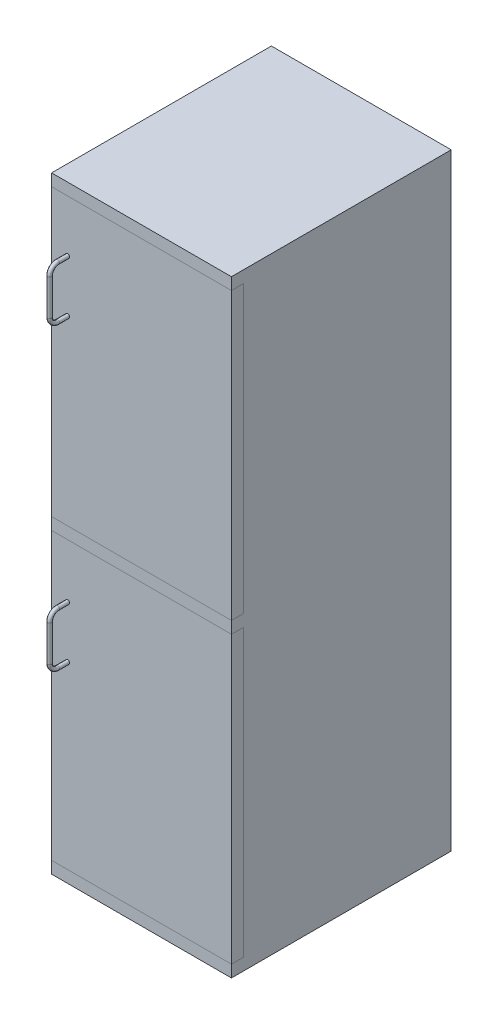
ISO-10303-21;
HEADER;
FILE_DESCRIPTION(('STEP AP214'),'2;1');
FILE_NAME('part.step','',(''),(''),'','','');
FILE_SCHEMA(('AUTOMOTIVE_DESIGN { 1 0 10303 214 1 1 1 1 }'));
ENDSEC;
DATA;
#1=APPLICATION_CONTEXT('core data for automotive mechanical design processes');
#2=APPLICATION_PROTOCOL_DEFINITION('international standard','automotive_design',2000,#1);
#3=PRODUCT_CONTEXT('',#1,'mechanical');
#4=PRODUCT('Part','Part','',(#3));
#5=PRODUCT_RELATED_PRODUCT_CATEGORY('part','',(#4));
#6=PRODUCT_DEFINITION_FORMATION('','',#4);
#7=PRODUCT_DEFINITION_CONTEXT('part definition',#1,'design');
#8=PRODUCT_DEFINITION('design','',#6,#7);
#9=PRODUCT_DEFINITION_SHAPE('','',#8);
#10=(LENGTH_UNIT() NAMED_UNIT(*) SI_UNIT(.MILLI.,.METRE.));
#11=(NAMED_UNIT(*) PLANE_ANGLE_UNIT() SI_UNIT($,.RADIAN.));
#12=(NAMED_UNIT(*) SI_UNIT($,.STERADIAN.) SOLID_ANGLE_UNIT());
#13=UNCERTAINTY_MEASURE_WITH_UNIT(LENGTH_MEASURE(1.E-05),#10,'distance_accuracy_value','');
#14=(GEOMETRIC_REPRESENTATION_CONTEXT(3) GLOBAL_UNCERTAINTY_ASSIGNED_CONTEXT((#13)) GLOBAL_UNIT_ASSIGNED_CONTEXT((#10,
#11,#12)) REPRESENTATION_CONTEXT('',''));
#15=CARTESIAN_POINT('',(0.,0.,0.));
#16=DIRECTION('',(0.,0.,1.));
#17=DIRECTION('',(1.,0.,0.));
#18=AXIS2_PLACEMENT_3D('',#15,#16,#17);
#19=CARTESIAN_POINT('',(0.,0.,0.));
#20=DIRECTION('',(0.,0.,-1.));
#21=DIRECTION('',(-1.,0.,0.));
#22=AXIS2_PLACEMENT_3D('',#19,#20,#21);
#23=PLANE('',#22);
#24=CARTESIAN_POINT('',(40.0000000000001,480.,0.));
#25=DIRECTION('',(0.,0.,-1.));
#26=DIRECTION('',(1.,0.,0.));
#27=AXIS2_PLACEMENT_3D('',#24,#25,#26);
#28=CIRCLE('',#27,5.);
#29=CARTESIAN_POINT('',(45.0000000000001,480.,0.));
#30=VERTEX_POINT('',#29);
#31=EDGE_CURVE('E113',#30,#30,#28,.T.);
#32=ORIENTED_EDGE('',*,*,#31,.T.);
#33=EDGE_LOOP('',(#32));
#34=FACE_BOUND('',#33,.T.);
#35=DIRECTION('',(-1.,0.,0.));
#36=VECTOR('',#35,1.);
#37=CARTESIAN_POINT('',(7.39289795290025E-12,745.,0.));
#38=LINE('',#37,#36);
#39=CARTESIAN_POINT('',(450.000000000008,745.,0.));
#40=VERTEX_POINT('',#39);
#41=CARTESIAN_POINT('',(7.39289795290025E-12,745.,0.));
#42=VERTEX_POINT('',#41);
#43=EDGE_CURVE('E95',#40,#42,#38,.T.);
#44=ORIENTED_EDGE('',*,*,#43,.T.);
#45=DIRECTION('',(0.,-1.,0.));
#46=VECTOR('',#45,1.);
#47=CARTESIAN_POINT('',(7.39289795290025E-12,745.,0.));
#48=LINE('',#47,#46);
#49=CARTESIAN_POINT('',(7.48046019903929E-12,30.,0.));
#50=VERTEX_POINT('',#49);
#51=EDGE_CURVE('E103',#42,#50,#48,.T.);
#52=ORIENTED_EDGE('',*,*,#51,.T.);
#53=DIRECTION('',(1.,0.,0.));
#54=VECTOR('',#53,1.);
#55=CARTESIAN_POINT('',(7.48046019903929E-12,30.,0.));
#56=LINE('',#55,#54);
#57=CARTESIAN_POINT('',(450.000000000008,30.,0.));
#58=VERTEX_POINT('',#57);
#59=EDGE_CURVE('E109',#50,#58,#56,.T.);
#60=ORIENTED_EDGE('',*,*,#59,.T.);
#61=DIRECTION('',(0.,1.,0.));
#62=VECTOR('',#61,1.);
#63=CARTESIAN_POINT('',(450.000000000008,745.,0.));
#64=LINE('',#63,#62);
#65=EDGE_CURVE('E101',#58,#40,#64,.T.);
#66=ORIENTED_EDGE('',*,*,#65,.T.);
#67=EDGE_LOOP('',(#44,#52,#60,#66));
#68=FACE_BOUND('',#67,.T.);
#69=CARTESIAN_POINT('',(40.0000000000001,610.,0.));
#70=DIRECTION('',(0.,0.,1.));
#71=DIRECTION('',(1.,0.,0.));
#72=AXIS2_PLACEMENT_3D('',#69,#70,#71);
#73=CIRCLE('',#72,5.);
#74=CARTESIAN_POINT('',(45.0000000000001,610.,0.));
#75=VERTEX_POINT('',#74);
#76=EDGE_CURVE('E12',#75,#75,#73,.T.);
#77=ORIENTED_EDGE('',*,*,#76,.F.);
#78=EDGE_LOOP('',(#77));
#79=FACE_BOUND('',#78,.T.);
#80=ADVANCED_FACE('F52',(#34,#68,#79),#23,.F.);
#81=CARTESIAN_POINT('',(7.39289795290025E-12,745.,-874.822466557324));
#82=DIRECTION('',(0.,1.,0.));
#83=DIRECTION('',(0.,0.,1.));
#84=AXIS2_PLACEMENT_3D('',#81,#82,#83);
#85=PLANE('',#84);
#86=DIRECTION('',(1.,0.,0.));
#87=VECTOR('',#86,1.);
#88=CARTESIAN_POINT('',(7.39289795290025E-12,745.,-30.));
#89=LINE('',#88,#87);
#90=CARTESIAN_POINT('',(7.39289795290025E-12,745.,-30.));
#91=VERTEX_POINT('',#90);
#92=CARTESIAN_POINT('',(450.000000000008,745.,-30.));
#93=VERTEX_POINT('',#92);
#94=EDGE_CURVE('E97',#91,#93,#89,.T.);
#95=ORIENTED_EDGE('',*,*,#94,.F.);
#96=DIRECTION('',(0.,0.,1.));
#97=VECTOR('',#96,1.);
#98=CARTESIAN_POINT('',(7.39289795290025E-12,745.,-874.822466557324));
#99=LINE('',#98,#97);
#100=EDGE_CURVE('E91',#91,#42,#99,.T.);
#101=ORIENTED_EDGE('',*,*,#100,.T.);
#102=ORIENTED_EDGE('',*,*,#43,.F.);
#103=DIRECTION('',(0.,0.,1.));
#104=VECTOR('',#103,1.);
#105=CARTESIAN_POINT('',(450.000000000008,745.,-874.822466557324));
#106=LINE('',#105,#104);
#107=EDGE_CURVE('E123',#93,#40,#106,.T.);
#108=ORIENTED_EDGE('',*,*,#107,.F.);
#109=EDGE_LOOP('',(#95,#101,#102,#108));
#110=FACE_BOUND('',#109,.T.);
#111=ADVANCED_FACE('F54',(#110),#85,.T.);
#112=CARTESIAN_POINT('',(450.000000000008,745.,-874.822466557324));
#113=DIRECTION('',(1.,0.,0.));
#114=DIRECTION('',(0.,0.,-1.));
#115=AXIS2_PLACEMENT_3D('',#112,#113,#114);
#116=PLANE('',#115);
#117=DIRECTION('',(0.,-1.,0.));
#118=VECTOR('',#117,1.);
#119=CARTESIAN_POINT('',(450.000000000008,745.,-30.));
#120=LINE('',#119,#118);
#121=CARTESIAN_POINT('',(450.000000000008,30.,-30.));
#122=VERTEX_POINT('',#121);
#123=EDGE_CURVE('E68',#93,#122,#120,.T.);
#124=ORIENTED_EDGE('',*,*,#123,.F.);
#125=ORIENTED_EDGE('',*,*,#107,.T.);
#126=ORIENTED_EDGE('',*,*,#65,.F.);
#127=DIRECTION('',(0.,0.,1.));
#128=VECTOR('',#127,1.);
#129=CARTESIAN_POINT('',(450.000000000008,30.,-874.822466557324));
#130=LINE('',#129,#128);
#131=EDGE_CURVE('E126',#122,#58,#130,.T.);
#132=ORIENTED_EDGE('',*,*,#131,.F.);
#133=EDGE_LOOP('',(#124,#125,#126,#132));
#134=FACE_BOUND('',#133,.T.);
#135=ADVANCED_FACE('F132',(#134),#116,.T.);
#136=CARTESIAN_POINT('',(7.48046019903929E-12,30.,-874.822466557324));
#137=DIRECTION('',(0.,-1.,0.));
#138=DIRECTION('',(0.,0.,-1.));
#139=AXIS2_PLACEMENT_3D('',#136,#137,#138);
#140=PLANE('',#139);
#141=DIRECTION('',(-1.,0.,0.));
#142=VECTOR('',#141,1.);
#143=CARTESIAN_POINT('',(7.48046019903929E-12,30.,-30.));
#144=LINE('',#143,#142);
#145=CARTESIAN_POINT('',(7.48046019903929E-12,30.,-30.));
#146=VERTEX_POINT('',#145);
#147=EDGE_CURVE('E125',#122,#146,#144,.T.);
#148=ORIENTED_EDGE('',*,*,#147,.F.);
#149=ORIENTED_EDGE('',*,*,#131,.T.);
#150=ORIENTED_EDGE('',*,*,#59,.F.);
#151=DIRECTION('',(0.,0.,1.));
#152=VECTOR('',#151,1.);
#153=CARTESIAN_POINT('',(7.48046019903929E-12,30.,-874.822466557324));
#154=LINE('',#153,#152);
#155=EDGE_CURVE('E100',#146,#50,#154,.T.);
#156=ORIENTED_EDGE('',*,*,#155,.F.);
#157=EDGE_LOOP('',(#148,#149,#150,#156));
#158=FACE_BOUND('',#157,.T.);
#159=ADVANCED_FACE('F130',(#158),#140,.T.);
#160=CARTESIAN_POINT('',(7.39289795290025E-12,745.,-874.822466557324));
#161=DIRECTION('',(-1.,0.,0.));
#162=DIRECTION('',(0.,-1.,0.));
#163=AXIS2_PLACEMENT_3D('',#160,#161,#162);
#164=PLANE('',#163);
#165=DIRECTION('',(0.,1.,0.));
#166=VECTOR('',#165,1.);
#167=CARTESIAN_POINT('',(7.39289795290025E-12,745.,-30.));
#168=LINE('',#167,#166);
#169=EDGE_CURVE('E56',#146,#91,#168,.T.);
#170=ORIENTED_EDGE('',*,*,#169,.F.);
#171=ORIENTED_EDGE('',*,*,#155,.T.);
#172=ORIENTED_EDGE('',*,*,#51,.F.);
#173=ORIENTED_EDGE('',*,*,#100,.F.);
#174=EDGE_LOOP('',(#170,#171,#172,#173));
#175=FACE_BOUND('',#174,.T.);
#176=ADVANCED_FACE('F104',(#175),#164,.T.);
#177=CARTESIAN_POINT('',(0.,0.,-30.));
#178=DIRECTION('',(0.,0.,1.));
#179=DIRECTION('',(1.,0.,0.));
#180=AXIS2_PLACEMENT_3D('',#177,#178,#179);
#181=PLANE('',#180);
#182=ORIENTED_EDGE('',*,*,#94,.T.);
#183=ORIENTED_EDGE('',*,*,#123,.T.);
#184=ORIENTED_EDGE('',*,*,#147,.T.);
#185=ORIENTED_EDGE('',*,*,#169,.T.);
#186=EDGE_LOOP('',(#182,#183,#184,#185));
#187=FACE_BOUND('',#186,.T.);
#188=ADVANCED_FACE('F152',(#187),#181,.F.);
#189=CARTESIAN_POINT('',(40.0000000000001,610.,0.));
#190=DIRECTION('',(0.,0.,1.));
#191=DIRECTION('',(1.,0.,0.));
#192=AXIS2_PLACEMENT_3D('',#189,#190,#191);
#193=CYLINDRICAL_SURFACE('',#192,5.);
#194=CARTESIAN_POINT('',(40.0000000000001,610.,25.));
#195=DIRECTION('',(0.,0.,1.));
#196=DIRECTION('',(1.,0.,0.));
#197=AXIS2_PLACEMENT_3D('',#194,#195,#196);
#198=CIRCLE('',#197,5.);
#199=CARTESIAN_POINT('',(40.0000000000001,615.,25.));
#200=VERTEX_POINT('',#199);
#201=EDGE_CURVE('E143',#200,#200,#198,.T.);
#202=ORIENTED_EDGE('',*,*,#201,.F.);
#203=EDGE_LOOP('',(#202));
#204=FACE_BOUND('',#203,.T.);
#205=ORIENTED_EDGE('',*,*,#76,.T.);
#206=EDGE_LOOP('',(#205));
#207=FACE_BOUND('',#206,.T.);
#208=ADVANCED_FACE('F149',(#204,#207),#193,.T.);
#209=CARTESIAN_POINT('',(40.0000000000001,590.,25.));
#210=DIRECTION('',(1.,0.,0.));
#211=DIRECTION('',(0.,0.,-1.));
#212=AXIS2_PLACEMENT_3D('',#209,#210,#211);
#213=TOROIDAL_SURFACE('',#212,20.,5.);
#214=CARTESIAN_POINT('',(40.0000000000001,590.,45.));
#215=DIRECTION('',(0.,-1.,0.));
#216=DIRECTION('',(1.,0.,0.));
#217=AXIS2_PLACEMENT_3D('',#214,#215,#216);
#218=CIRCLE('',#217,5.);
#219=CARTESIAN_POINT('',(40.0000000000001,590.,50.));
#220=VERTEX_POINT('',#219);
#221=EDGE_CURVE('E140',#220,#220,#218,.T.);
#222=CARTESIAN_POINT('',(40.0000000000001,590.,25.));
#223=DIRECTION('',(1.,0.,0.));
#224=DIRECTION('',(0.,0.,-1.));
#225=AXIS2_PLACEMENT_3D('',#222,#223,#224);
#226=CIRCLE('',#225,25.);
#227=EDGE_CURVE('',#200,#220,#226,.T.);
#228=ORIENTED_EDGE('',*,*,#201,.T.);
#229=ORIENTED_EDGE('',*,*,#221,.F.);
#230=ORIENTED_EDGE('',*,*,#227,.T.);
#231=ORIENTED_EDGE('',*,*,#227,.F.);
#232=EDGE_LOOP('',(#228,#230,#229,#231));
#233=FACE_BOUND('',#232,.T.);
#234=ADVANCED_FACE('F147',(#233),#213,.T.);
#235=CARTESIAN_POINT('',(40.0000000000001,590.,45.));
#236=DIRECTION('',(0.,-1.,0.));
#237=DIRECTION('',(0.,0.,-1.));
#238=AXIS2_PLACEMENT_3D('',#235,#236,#237);
#239=CYLINDRICAL_SURFACE('',#238,5.);
#240=CARTESIAN_POINT('',(40.0000000000001,500.,45.));
#241=DIRECTION('',(0.,-1.,0.));
#242=DIRECTION('',(1.,0.,0.));
#243=AXIS2_PLACEMENT_3D('',#240,#241,#242);
#244=CIRCLE('',#243,5.);
#245=CARTESIAN_POINT('',(40.0000000000001,500.,50.));
#246=VERTEX_POINT('',#245);
#247=EDGE_CURVE('E137',#246,#246,#244,.T.);
#248=ORIENTED_EDGE('',*,*,#247,.F.);
#249=EDGE_LOOP('',(#248));
#250=FACE_BOUND('',#249,.T.);
#251=ORIENTED_EDGE('',*,*,#221,.T.);
#252=EDGE_LOOP('',(#251));
#253=FACE_BOUND('',#252,.T.);
#254=ADVANCED_FACE('F180',(#250,#253),#239,.T.);
#255=CARTESIAN_POINT('',(40.0000000000001,500.,25.));
#256=DIRECTION('',(1.,0.,0.));
#257=DIRECTION('',(0.,0.,-1.));
#258=AXIS2_PLACEMENT_3D('',#255,#256,#257);
#259=TOROIDAL_SURFACE('',#258,20.,5.);
#260=CARTESIAN_POINT('',(40.0000000000001,480.,25.));
#261=DIRECTION('',(0.,0.,-1.));
#262=DIRECTION('',(1.,0.,0.));
#263=AXIS2_PLACEMENT_3D('',#260,#261,#262);
#264=CIRCLE('',#263,5.);
#265=CARTESIAN_POINT('',(40.0000000000001,475.,25.));
#266=VERTEX_POINT('',#265);
#267=EDGE_CURVE('E116',#266,#266,#264,.T.);
#268=CARTESIAN_POINT('',(40.0000000000001,500.,25.));
#269=DIRECTION('',(1.,0.,0.));
#270=DIRECTION('',(0.,0.,-1.));
#271=AXIS2_PLACEMENT_3D('',#268,#269,#270);
#272=CIRCLE('',#271,25.);
#273=EDGE_CURVE('',#246,#266,#272,.T.);
#274=ORIENTED_EDGE('',*,*,#247,.T.);
#275=ORIENTED_EDGE('',*,*,#267,.F.);
#276=ORIENTED_EDGE('',*,*,#273,.T.);
#277=ORIENTED_EDGE('',*,*,#273,.F.);
#278=EDGE_LOOP('',(#274,#276,#275,#277));
#279=FACE_BOUND('',#278,.T.);
#280=ADVANCED_FACE('F175',(#279),#259,.T.);
#281=CARTESIAN_POINT('',(40.0000000000001,480.,25.));
#282=DIRECTION('',(0.,0.,-1.));
#283=DIRECTION('',(-1.,0.,0.));
#284=AXIS2_PLACEMENT_3D('',#281,#282,#283);
#285=CYLINDRICAL_SURFACE('',#284,5.);
#286=ORIENTED_EDGE('',*,*,#31,.F.);
#287=EDGE_LOOP('',(#286));
#288=FACE_BOUND('',#287,.T.);
#289=ORIENTED_EDGE('',*,*,#267,.T.);
#290=EDGE_LOOP('',(#289));
#291=FACE_BOUND('',#290,.T.);
#292=ADVANCED_FACE('F171',(#288,#291),#285,.T.);
#293=CLOSED_SHELL('',(#80,#111,#135,#159,#176,#188,#208,#234,#254,#280,#292));
#294=MANIFOLD_SOLID_BREP('B2',#293);
#295=CARTESIAN_POINT('',(0.,0.,0.));
#296=DIRECTION('',(0.,0.,1.));
#297=DIRECTION('',(1.,0.,0.));
#298=AXIS2_PLACEMENT_3D('',#295,#296,#297);
#299=PLANE('',#298);
#300=CARTESIAN_POINT('',(40.,1230.,0.));
#301=DIRECTION('',(0.,0.,-1.));
#302=DIRECTION('',(1.,0.,0.));
#303=AXIS2_PLACEMENT_3D('',#300,#301,#302);
#304=CIRCLE('',#303,5.);
#305=CARTESIAN_POINT('',(45.,1230.,0.));
#306=VERTEX_POINT('',#305);
#307=EDGE_CURVE('E327',#306,#306,#304,.T.);
#308=ORIENTED_EDGE('',*,*,#307,.T.);
#309=EDGE_LOOP('',(#308));
#310=FACE_BOUND('',#309,.T.);
#311=DIRECTION('',(0.,-1.,0.));
#312=VECTOR('',#311,1.);
#313=CARTESIAN_POINT('',(0.,1490.,0.));
#314=LINE('',#313,#312);
#315=CARTESIAN_POINT('',(0.,1490.,0.));
#316=VERTEX_POINT('',#315);
#317=CARTESIAN_POINT('',(0.,775.,0.));
#318=VERTEX_POINT('',#317);
#319=EDGE_CURVE('E309',#316,#318,#314,.T.);
#320=ORIENTED_EDGE('',*,*,#319,.T.);
#321=DIRECTION('',(1.,0.,0.));
#322=VECTOR('',#321,1.);
#323=CARTESIAN_POINT('',(0.,775.,0.));
#324=LINE('',#323,#322);
#325=CARTESIAN_POINT('',(450.,775.,0.));
#326=VERTEX_POINT('',#325);
#327=EDGE_CURVE('E317',#318,#326,#324,.T.);
#328=ORIENTED_EDGE('',*,*,#327,.T.);
#329=DIRECTION('',(0.,1.,0.));
#330=VECTOR('',#329,1.);
#331=CARTESIAN_POINT('',(450.,1490.,0.));
#332=LINE('',#331,#330);
#333=CARTESIAN_POINT('',(450.,1490.,0.));
#334=VERTEX_POINT('',#333);
#335=EDGE_CURVE('E323',#326,#334,#332,.T.);
#336=ORIENTED_EDGE('',*,*,#335,.T.);
#337=DIRECTION('',(-1.,0.,0.));
#338=VECTOR('',#337,1.);
#339=CARTESIAN_POINT('',(0.,1490.,0.));
#340=LINE('',#339,#338);
#341=EDGE_CURVE('E315',#334,#316,#340,.T.);
#342=ORIENTED_EDGE('',*,*,#341,.T.);
#343=EDGE_LOOP('',(#320,#328,#336,#342));
#344=FACE_BOUND('',#343,.T.);
#345=CARTESIAN_POINT('',(40.,1360.,0.));
#346=DIRECTION('',(0.,0.,1.));
#347=DIRECTION('',(1.,0.,0.));
#348=AXIS2_PLACEMENT_3D('',#345,#346,#347);
#349=CIRCLE('',#348,5.);
#350=CARTESIAN_POINT('',(45.,1360.,0.));
#351=VERTEX_POINT('',#350);
#352=EDGE_CURVE('E50',#351,#351,#349,.T.);
#353=ORIENTED_EDGE('',*,*,#352,.F.);
#354=EDGE_LOOP('',(#353));
#355=FACE_BOUND('',#354,.T.);
#356=ADVANCED_FACE('F266',(#310,#344,#355),#299,.T.);
#357=CARTESIAN_POINT('',(0.,1490.,-874.822466557324));
#358=DIRECTION('',(-1.,0.,0.));
#359=DIRECTION('',(0.,-1.,0.));
#360=AXIS2_PLACEMENT_3D('',#357,#358,#359);
#361=PLANE('',#360);
#362=DIRECTION('',(0.,1.,0.));
#363=VECTOR('',#362,1.);
#364=CARTESIAN_POINT('',(0.,1490.,-30.));
#365=LINE('',#364,#363);
#366=CARTESIAN_POINT('',(0.,775.,-30.));
#367=VERTEX_POINT('',#366);
#368=CARTESIAN_POINT('',(0.,1490.,-30.));
#369=VERTEX_POINT('',#368);
#370=EDGE_CURVE('E311',#367,#369,#365,.T.);
#371=ORIENTED_EDGE('',*,*,#370,.F.);
#372=DIRECTION('',(0.,0.,1.));
#373=VECTOR('',#372,1.);
#374=CARTESIAN_POINT('',(0.,775.,-874.822466557324));
#375=LINE('',#374,#373);
#376=EDGE_CURVE('E305',#367,#318,#375,.T.);
#377=ORIENTED_EDGE('',*,*,#376,.T.);
#378=ORIENTED_EDGE('',*,*,#319,.F.);
#379=DIRECTION('',(0.,0.,1.));
#380=VECTOR('',#379,1.);
#381=CARTESIAN_POINT('',(0.,1490.,-874.822466557324));
#382=LINE('',#381,#380);
#383=EDGE_CURVE('E337',#369,#316,#382,.T.);
#384=ORIENTED_EDGE('',*,*,#383,.F.);
#385=EDGE_LOOP('',(#371,#377,#378,#384));
#386=FACE_BOUND('',#385,.T.);
#387=ADVANCED_FACE('F268',(#386),#361,.T.);
#388=CARTESIAN_POINT('',(0.,1490.,-874.822466557324));
#389=DIRECTION('',(0.,1.,0.));
#390=DIRECTION('',(0.,0.,1.));
#391=AXIS2_PLACEMENT_3D('',#388,#389,#390);
#392=PLANE('',#391);
#393=DIRECTION('',(1.,0.,0.));
#394=VECTOR('',#393,1.);
#395=CARTESIAN_POINT('',(0.,1490.,-30.));
#396=LINE('',#395,#394);
#397=CARTESIAN_POINT('',(450.,1490.,-30.));
#398=VERTEX_POINT('',#397);
#399=EDGE_CURVE('E282',#369,#398,#396,.T.);
#400=ORIENTED_EDGE('',*,*,#399,.F.);
#401=ORIENTED_EDGE('',*,*,#383,.T.);
#402=ORIENTED_EDGE('',*,*,#341,.F.);
#403=DIRECTION('',(0.,0.,1.));
#404=VECTOR('',#403,1.);
#405=CARTESIAN_POINT('',(450.,1490.,-874.822466557324));
#406=LINE('',#405,#404);
#407=EDGE_CURVE('E340',#398,#334,#406,.T.);
#408=ORIENTED_EDGE('',*,*,#407,.F.);
#409=EDGE_LOOP('',(#400,#401,#402,#408));
#410=FACE_BOUND('',#409,.T.);
#411=ADVANCED_FACE('F346',(#410),#392,.T.);
#412=CARTESIAN_POINT('',(450.,1490.,-874.822466557324));
#413=DIRECTION('',(1.,0.,0.));
#414=DIRECTION('',(0.,0.,-1.));
#415=AXIS2_PLACEMENT_3D('',#412,#413,#414);
#416=PLANE('',#415);
#417=DIRECTION('',(0.,-1.,0.));
#418=VECTOR('',#417,1.);
#419=CARTESIAN_POINT('',(450.,1490.,-30.));
#420=LINE('',#419,#418);
#421=CARTESIAN_POINT('',(450.,775.,-30.));
#422=VERTEX_POINT('',#421);
#423=EDGE_CURVE('E339',#398,#422,#420,.T.);
#424=ORIENTED_EDGE('',*,*,#423,.F.);
#425=ORIENTED_EDGE('',*,*,#407,.T.);
#426=ORIENTED_EDGE('',*,*,#335,.F.);
#427=DIRECTION('',(0.,0.,1.));
#428=VECTOR('',#427,1.);
#429=CARTESIAN_POINT('',(450.,775.,-874.822466557324));
#430=LINE('',#429,#428);
#431=EDGE_CURVE('E314',#422,#326,#430,.T.);
#432=ORIENTED_EDGE('',*,*,#431,.F.);
#433=EDGE_LOOP('',(#424,#425,#426,#432));
#434=FACE_BOUND('',#433,.T.);
#435=ADVANCED_FACE('F344',(#434),#416,.T.);
#436=CARTESIAN_POINT('',(0.,775.,-874.822466557324));
#437=DIRECTION('',(0.,-1.,0.));
#438=DIRECTION('',(0.,0.,-1.));
#439=AXIS2_PLACEMENT_3D('',#436,#437,#438);
#440=PLANE('',#439);
#441=DIRECTION('',(-1.,0.,0.));
#442=VECTOR('',#441,1.);
#443=CARTESIAN_POINT('',(0.,775.,-30.));
#444=LINE('',#443,#442);
#445=EDGE_CURVE('E270',#422,#367,#444,.T.);
#446=ORIENTED_EDGE('',*,*,#445,.F.);
#447=ORIENTED_EDGE('',*,*,#431,.T.);
#448=ORIENTED_EDGE('',*,*,#327,.F.);
#449=ORIENTED_EDGE('',*,*,#376,.F.);
#450=EDGE_LOOP('',(#446,#447,#448,#449));
#451=FACE_BOUND('',#450,.T.);
#452=ADVANCED_FACE('F318',(#451),#440,.T.);
#453=CARTESIAN_POINT('',(0.,0.,-30.));
#454=DIRECTION('',(0.,0.,1.));
#455=DIRECTION('',(1.,0.,0.));
#456=AXIS2_PLACEMENT_3D('',#453,#454,#455);
#457=PLANE('',#456);
#458=ORIENTED_EDGE('',*,*,#370,.T.);
#459=ORIENTED_EDGE('',*,*,#399,.T.);
#460=ORIENTED_EDGE('',*,*,#423,.T.);
#461=ORIENTED_EDGE('',*,*,#445,.T.);
#462=EDGE_LOOP('',(#458,#459,#460,#461));
#463=FACE_BOUND('',#462,.T.);
#464=ADVANCED_FACE('F366',(#463),#457,.F.);
#465=CARTESIAN_POINT('',(40.,1360.,0.));
#466=DIRECTION('',(0.,0.,1.));
#467=DIRECTION('',(1.,0.,0.));
#468=AXIS2_PLACEMENT_3D('',#465,#466,#467);
#469=CYLINDRICAL_SURFACE('',#468,5.);
#470=CARTESIAN_POINT('',(40.,1360.,25.));
#471=DIRECTION('',(0.,0.,1.));
#472=DIRECTION('',(1.,0.,0.));
#473=AXIS2_PLACEMENT_3D('',#470,#471,#472);
#474=CIRCLE('',#473,5.);
#475=CARTESIAN_POINT('',(40.,1365.,25.));
#476=VERTEX_POINT('',#475);
#477=EDGE_CURVE('E357',#476,#476,#474,.T.);
#478=ORIENTED_EDGE('',*,*,#477,.F.);
#479=EDGE_LOOP('',(#478));
#480=FACE_BOUND('',#479,.T.);
#481=ORIENTED_EDGE('',*,*,#352,.T.);
#482=EDGE_LOOP('',(#481));
#483=FACE_BOUND('',#482,.T.);
#484=ADVANCED_FACE('F363',(#480,#483),#469,.T.);
#485=CARTESIAN_POINT('',(40.,1340.,25.));
#486=DIRECTION('',(1.,0.,0.));
#487=DIRECTION('',(0.,0.,-1.));
#488=AXIS2_PLACEMENT_3D('',#485,#486,#487);
#489=TOROIDAL_SURFACE('',#488,20.,5.);
#490=CARTESIAN_POINT('',(40.,1340.,44.9999999999999));
#491=DIRECTION('',(0.,-1.,0.));
#492=DIRECTION('',(1.,0.,0.));
#493=AXIS2_PLACEMENT_3D('',#490,#491,#492);
#494=CIRCLE('',#493,5.);
#495=CARTESIAN_POINT('',(40.,1340.,50.));
#496=VERTEX_POINT('',#495);
#497=EDGE_CURVE('E354',#496,#496,#494,.T.);
#498=CARTESIAN_POINT('',(40.,1340.,25.));
#499=DIRECTION('',(1.,0.,0.));
#500=DIRECTION('',(0.,0.,-1.));
#501=AXIS2_PLACEMENT_3D('',#498,#499,#500);
#502=CIRCLE('',#501,25.);
#503=EDGE_CURVE('',#476,#496,#502,.T.);
#504=ORIENTED_EDGE('',*,*,#477,.T.);
#505=ORIENTED_EDGE('',*,*,#497,.F.);
#506=ORIENTED_EDGE('',*,*,#503,.T.);
#507=ORIENTED_EDGE('',*,*,#503,.F.);
#508=EDGE_LOOP('',(#504,#506,#505,#507));
#509=FACE_BOUND('',#508,.T.);
#510=ADVANCED_FACE('F361',(#509),#489,.T.);
#511=CARTESIAN_POINT('',(40.,1340.,44.9999999999999));
#512=DIRECTION('',(0.,-1.,0.));
#513=DIRECTION('',(0.,0.,-1.));
#514=AXIS2_PLACEMENT_3D('',#511,#512,#513);
#515=CYLINDRICAL_SURFACE('',#514,5.);
#516=CARTESIAN_POINT('',(40.,1250.,44.9999999999999));
#517=DIRECTION('',(0.,-1.,0.));
#518=DIRECTION('',(1.,0.,0.));
#519=AXIS2_PLACEMENT_3D('',#516,#517,#518);
#520=CIRCLE('',#519,5.);
#521=CARTESIAN_POINT('',(40.,1250.,49.9999999999999));
#522=VERTEX_POINT('',#521);
#523=EDGE_CURVE('E351',#522,#522,#520,.T.);
#524=ORIENTED_EDGE('',*,*,#523,.F.);
#525=EDGE_LOOP('',(#524));
#526=FACE_BOUND('',#525,.T.);
#527=ORIENTED_EDGE('',*,*,#497,.T.);
#528=EDGE_LOOP('',(#527));
#529=FACE_BOUND('',#528,.T.);
#530=ADVANCED_FACE('F394',(#526,#529),#515,.T.);
#531=CARTESIAN_POINT('',(40.,1250.,25.));
#532=DIRECTION('',(1.,0.,0.));
#533=DIRECTION('',(0.,0.,-1.));
#534=AXIS2_PLACEMENT_3D('',#531,#532,#533);
#535=TOROIDAL_SURFACE('',#534,19.9999999999999,5.);
#536=CARTESIAN_POINT('',(40.,1230.,25.));
#537=DIRECTION('',(0.,0.,-1.));
#538=DIRECTION('',(1.,0.,0.));
#539=AXIS2_PLACEMENT_3D('',#536,#537,#538);
#540=CIRCLE('',#539,5.);
#541=CARTESIAN_POINT('',(40.,1225.,25.));
#542=VERTEX_POINT('',#541);
#543=EDGE_CURVE('E330',#542,#542,#540,.T.);
#544=CARTESIAN_POINT('',(40.,1250.,25.));
#545=DIRECTION('',(1.,0.,0.));
#546=DIRECTION('',(0.,0.,-1.));
#547=AXIS2_PLACEMENT_3D('',#544,#545,#546);
#548=CIRCLE('',#547,24.9999999999999);
#549=EDGE_CURVE('',#522,#542,#548,.T.);
#550=ORIENTED_EDGE('',*,*,#523,.T.);
#551=ORIENTED_EDGE('',*,*,#543,.F.);
#552=ORIENTED_EDGE('',*,*,#549,.T.);
#553=ORIENTED_EDGE('',*,*,#549,.F.);
#554=EDGE_LOOP('',(#550,#552,#551,#553));
#555=FACE_BOUND('',#554,.T.);
#556=ADVANCED_FACE('F389',(#555),#535,.T.);
#557=CARTESIAN_POINT('',(40.,1230.,25.));
#558=DIRECTION('',(0.,0.,-1.));
#559=DIRECTION('',(-1.,0.,0.));
#560=AXIS2_PLACEMENT_3D('',#557,#558,#559);
#561=CYLINDRICAL_SURFACE('',#560,5.);
#562=ORIENTED_EDGE('',*,*,#307,.F.);
#563=EDGE_LOOP('',(#562));
#564=FACE_BOUND('',#563,.T.);
#565=ORIENTED_EDGE('',*,*,#543,.T.);
#566=EDGE_LOOP('',(#565));
#567=FACE_BOUND('',#566,.T.);
#568=ADVANCED_FACE('F385',(#564,#567),#561,.T.);
#569=CLOSED_SHELL('',(#356,#387,#411,#435,#452,#464,#484,#510,#530,#556,#568));
#570=MANIFOLD_SOLID_BREP('B6',#569);
#571=CARTESIAN_POINT('',(0.,0.,0.));
#572=DIRECTION('',(0.,0.,1.));
#573=DIRECTION('',(1.,0.,0.));
#574=AXIS2_PLACEMENT_3D('',#571,#572,#573);
#575=PLANE('',#574);
#576=DIRECTION('',(-1.,0.,0.));
#577=VECTOR('',#576,1.);
#578=CARTESIAN_POINT('',(0.,1490.,0.));
#579=LINE('',#578,#577);
#580=CARTESIAN_POINT('',(450.,1490.,0.));
#581=VERTEX_POINT('',#580);
#582=CARTESIAN_POINT('',(0.,1490.,0.));
#583=VERTEX_POINT('',#582);
#584=EDGE_CURVE('E578',#581,#583,#579,.T.);
#585=ORIENTED_EDGE('',*,*,#584,.F.);
#586=DIRECTION('',(0.,1.,0.));
#587=VECTOR('',#586,1.);
#588=CARTESIAN_POINT('',(450.,0.,0.));
#589=LINE('',#588,#587);
#590=CARTESIAN_POINT('',(450.,1520.,0.));
#591=VERTEX_POINT('',#590);
#592=EDGE_CURVE('E649',#581,#591,#589,.T.);
#593=ORIENTED_EDGE('',*,*,#592,.T.);
#594=DIRECTION('',(1.,0.,0.));
#595=VECTOR('',#594,1.);
#596=CARTESIAN_POINT('',(0.,1520.,0.));
#597=LINE('',#596,#595);
#598=CARTESIAN_POINT('',(0.,1520.,0.));
#599=VERTEX_POINT('',#598);
#600=EDGE_CURVE('E645',#599,#591,#597,.T.);
#601=ORIENTED_EDGE('',*,*,#600,.F.);
#602=DIRECTION('',(0.,1.,0.));
#603=VECTOR('',#602,1.);
#604=CARTESIAN_POINT('',(0.,0.,0.));
#605=LINE('',#604,#603);
#606=EDGE_CURVE('E660',#583,#599,#605,.T.);
#607=ORIENTED_EDGE('',*,*,#606,.F.);
#608=EDGE_LOOP('',(#585,#593,#601,#607));
#609=FACE_BOUND('',#608,.T.);
#610=ADVANCED_FACE('F471',(#609),#575,.T.);
#611=DIRECTION('',(1.,0.,0.));
#612=VECTOR('',#611,1.);
#613=CARTESIAN_POINT('',(0.,775.,0.));
#614=LINE('',#613,#612);
#615=CARTESIAN_POINT('',(0.,775.,0.));
#616=VERTEX_POINT('',#615);
#617=CARTESIAN_POINT('',(450.,775.,0.));
#618=VERTEX_POINT('',#617);
#619=EDGE_CURVE('E620',#616,#618,#614,.T.);
#620=ORIENTED_EDGE('',*,*,#619,.F.);
#621=CARTESIAN_POINT('',(7.39289795290025E-12,745.,0.));
#622=VERTEX_POINT('',#621);
#623=EDGE_CURVE('E584',#622,#616,#605,.T.);
#624=ORIENTED_EDGE('',*,*,#623,.F.);
#625=DIRECTION('',(-1.,0.,0.));
#626=VECTOR('',#625,1.);
#627=CARTESIAN_POINT('',(7.39289795290025E-12,745.,0.));
#628=LINE('',#627,#626);
#629=CARTESIAN_POINT('',(450.000000000008,745.,0.));
#630=VERTEX_POINT('',#629);
#631=EDGE_CURVE('E612',#630,#622,#628,.T.);
#632=ORIENTED_EDGE('',*,*,#631,.F.);
#633=EDGE_CURVE('E656',#630,#618,#589,.T.);
#634=ORIENTED_EDGE('',*,*,#633,.T.);
#635=EDGE_LOOP('',(#620,#624,#632,#634));
#636=FACE_BOUND('',#635,.T.);
#637=ADVANCED_FACE('F702',(#636),#575,.T.);
#638=CARTESIAN_POINT('',(0.,1520.,-550.));
#639=DIRECTION('',(0.,-1.,0.));
#640=DIRECTION('',(0.,0.,-1.));
#641=AXIS2_PLACEMENT_3D('',#638,#639,#640);
#642=PLANE('',#641);
#643=ORIENTED_EDGE('',*,*,#600,.T.);
#644=DIRECTION('',(0.,0.,1.));
#645=VECTOR('',#644,1.);
#646=CARTESIAN_POINT('',(450.,1520.,-550.));
#647=LINE('',#646,#645);
#648=CARTESIAN_POINT('',(450.,1520.,-550.));
#649=VERTEX_POINT('',#648);
#650=EDGE_CURVE('E264',#649,#591,#647,.T.);
#651=ORIENTED_EDGE('',*,*,#650,.F.);
#652=DIRECTION('',(1.,0.,0.));
#653=VECTOR('',#652,1.);
#654=CARTESIAN_POINT('',(0.,1520.,-550.));
#655=LINE('',#654,#653);
#656=CARTESIAN_POINT('',(0.,1520.,-550.));
#657=VERTEX_POINT('',#656);
#658=EDGE_CURVE('E629',#657,#649,#655,.T.);
#659=ORIENTED_EDGE('',*,*,#658,.F.);
#660=DIRECTION('',(0.,0.,1.));
#661=VECTOR('',#660,1.);
#662=CARTESIAN_POINT('',(0.,1520.,-550.));
#663=LINE('',#662,#661);
#664=EDGE_CURVE('E644',#657,#599,#663,.T.);
#665=ORIENTED_EDGE('',*,*,#664,.T.);
#666=EDGE_LOOP('',(#643,#651,#659,#665));
#667=FACE_BOUND('',#666,.T.);
#668=ADVANCED_FACE('F473',(#667),#642,.F.);
#669=CARTESIAN_POINT('',(450.,0.,-550.));
#670=DIRECTION('',(1.,0.,0.));
#671=DIRECTION('',(0.,0.,-1.));
#672=AXIS2_PLACEMENT_3D('',#669,#670,#671);
#673=PLANE('',#672);
#674=DIRECTION('',(0.,0.,1.));
#675=VECTOR('',#674,1.);
#676=CARTESIAN_POINT('',(450.,1490.,-30.));
#677=LINE('',#676,#675);
#678=CARTESIAN_POINT('',(450.,1490.,-30.));
#679=VERTEX_POINT('',#678);
#680=EDGE_CURVE('E589',#679,#581,#677,.T.);
#681=ORIENTED_EDGE('',*,*,#680,.F.);
#682=DIRECTION('',(0.,1.,0.));
#683=VECTOR('',#682,1.);
#684=CARTESIAN_POINT('',(450.,1490.,-30.));
#685=LINE('',#684,#683);
#686=CARTESIAN_POINT('',(450.,775.,-30.));
#687=VERTEX_POINT('',#686);
#688=EDGE_CURVE('E567',#687,#679,#685,.T.);
#689=ORIENTED_EDGE('',*,*,#688,.F.);
#690=DIRECTION('',(0.,0.,1.));
#691=VECTOR('',#690,1.);
#692=CARTESIAN_POINT('',(450.,775.,-30.));
#693=LINE('',#692,#691);
#694=EDGE_CURVE('E563',#687,#618,#693,.T.);
#695=ORIENTED_EDGE('',*,*,#694,.T.);
#696=ORIENTED_EDGE('',*,*,#633,.F.);
#697=DIRECTION('',(0.,0.,1.));
#698=VECTOR('',#697,1.);
#699=CARTESIAN_POINT('',(450.000000000008,745.,-30.));
#700=LINE('',#699,#698);
#701=CARTESIAN_POINT('',(450.000000000008,745.,-30.));
#702=VERTEX_POINT('',#701);
#703=EDGE_CURVE('E617',#702,#630,#700,.T.);
#704=ORIENTED_EDGE('',*,*,#703,.F.);
#705=DIRECTION('',(0.,1.,0.));
#706=VECTOR('',#705,1.);
#707=CARTESIAN_POINT('',(450.000000000008,745.,-30.));
#708=LINE('',#707,#706);
#709=CARTESIAN_POINT('',(450.000000000008,30.,-30.));
#710=VERTEX_POINT('',#709);
#711=EDGE_CURVE('E607',#710,#702,#708,.T.);
#712=ORIENTED_EDGE('',*,*,#711,.F.);
#713=DIRECTION('',(0.,0.,1.));
#714=VECTOR('',#713,1.);
#715=CARTESIAN_POINT('',(450.000000000008,30.,-30.));
#716=LINE('',#715,#714);
#717=CARTESIAN_POINT('',(450.000000000008,30.,0.));
#718=VERTEX_POINT('',#717);
#719=EDGE_CURVE('E621',#710,#718,#716,.T.);
#720=ORIENTED_EDGE('',*,*,#719,.T.);
#721=CARTESIAN_POINT('',(450.,0.,0.));
#722=VERTEX_POINT('',#721);
#723=EDGE_CURVE('E651',#722,#718,#589,.T.);
#724=ORIENTED_EDGE('',*,*,#723,.F.);
#725=DIRECTION('',(0.,0.,1.));
#726=VECTOR('',#725,1.);
#727=CARTESIAN_POINT('',(450.,0.,-550.));
#728=LINE('',#727,#726);
#729=CARTESIAN_POINT('',(450.,0.,-550.));
#730=VERTEX_POINT('',#729);
#731=EDGE_CURVE('E480',#730,#722,#728,.T.);
#732=ORIENTED_EDGE('',*,*,#731,.F.);
#733=DIRECTION('',(0.,1.,0.));
#734=VECTOR('',#733,1.);
#735=CARTESIAN_POINT('',(450.,0.,-550.));
#736=LINE('',#735,#734);
#737=EDGE_CURVE('E632',#730,#649,#736,.T.);
#738=ORIENTED_EDGE('',*,*,#737,.T.);
#739=ORIENTED_EDGE('',*,*,#650,.T.);
#740=ORIENTED_EDGE('',*,*,#592,.F.);
#741=EDGE_LOOP('',(#681,#689,#695,#696,#704,#712,#720,#724,#732,#738,#739,#740));
#742=FACE_BOUND('',#741,.T.);
#743=ADVANCED_FACE('F678',(#742),#673,.T.);
#744=CARTESIAN_POINT('',(0.,0.,-550.));
#745=DIRECTION('',(0.,-1.,0.));
#746=DIRECTION('',(0.,0.,-1.));
#747=AXIS2_PLACEMENT_3D('',#744,#745,#746);
#748=PLANE('',#747);
#749=DIRECTION('',(1.,0.,0.));
#750=VECTOR('',#749,1.);
#751=CARTESIAN_POINT('',(0.,0.,0.));
#752=LINE('',#751,#750);
#753=CARTESIAN_POINT('',(0.,0.,0.));
#754=VERTEX_POINT('',#753);
#755=EDGE_CURVE('E655',#754,#722,#752,.T.);
#756=ORIENTED_EDGE('',*,*,#755,.F.);
#757=DIRECTION('',(0.,0.,1.));
#758=VECTOR('',#757,1.);
#759=CARTESIAN_POINT('',(0.,0.,-550.));
#760=LINE('',#759,#758);
#761=CARTESIAN_POINT('',(0.,0.,-550.));
#762=VERTEX_POINT('',#761);
#763=EDGE_CURVE('E667',#762,#754,#760,.T.);
#764=ORIENTED_EDGE('',*,*,#763,.F.);
#765=DIRECTION('',(1.,0.,0.));
#766=VECTOR('',#765,1.);
#767=CARTESIAN_POINT('',(0.,0.,-550.));
#768=LINE('',#767,#766);
#769=EDGE_CURVE('E637',#762,#730,#768,.T.);
#770=ORIENTED_EDGE('',*,*,#769,.T.);
#771=ORIENTED_EDGE('',*,*,#731,.T.);
#772=EDGE_LOOP('',(#756,#764,#770,#771));
#773=FACE_BOUND('',#772,.T.);
#774=ADVANCED_FACE('F673',(#773),#748,.T.);
#775=CARTESIAN_POINT('',(0.,0.,-550.));
#776=DIRECTION('',(1.,0.,0.));
#777=DIRECTION('',(0.,0.,-1.));
#778=AXIS2_PLACEMENT_3D('',#775,#776,#777);
#779=PLANE('',#778);
#780=DIRECTION('',(0.,-1.,0.));
#781=VECTOR('',#780,1.);
#782=CARTESIAN_POINT('',(0.,1490.,-30.));
#783=LINE('',#782,#781);
#784=CARTESIAN_POINT('',(0.,1490.,-30.));
#785=VERTEX_POINT('',#784);
#786=CARTESIAN_POINT('',(0.,775.,-30.));
#787=VERTEX_POINT('',#786);
#788=EDGE_CURVE('E568',#785,#787,#783,.T.);
#789=ORIENTED_EDGE('',*,*,#788,.F.);
#790=DIRECTION('',(0.,0.,1.));
#791=VECTOR('',#790,1.);
#792=CARTESIAN_POINT('',(0.,1490.,-30.));
#793=LINE('',#792,#791);
#794=EDGE_CURVE('E650',#785,#583,#793,.T.);
#795=ORIENTED_EDGE('',*,*,#794,.T.);
#796=ORIENTED_EDGE('',*,*,#606,.T.);
#797=ORIENTED_EDGE('',*,*,#664,.F.);
#798=DIRECTION('',(0.,1.,0.));
#799=VECTOR('',#798,1.);
#800=CARTESIAN_POINT('',(0.,0.,-550.));
#801=LINE('',#800,#799);
#802=EDGE_CURVE('E641',#762,#657,#801,.T.);
#803=ORIENTED_EDGE('',*,*,#802,.F.);
#804=ORIENTED_EDGE('',*,*,#763,.T.);
#805=CARTESIAN_POINT('',(0.,30.,0.));
#806=VERTEX_POINT('',#805);
#807=EDGE_CURVE('E633',#754,#806,#605,.T.);
#808=ORIENTED_EDGE('',*,*,#807,.T.);
#809=DIRECTION('',(0.,0.,1.));
#810=VECTOR('',#809,1.);
#811=CARTESIAN_POINT('',(7.48046019903929E-12,30.,-30.));
#812=LINE('',#811,#810);
#813=CARTESIAN_POINT('',(7.48046019903929E-12,30.,-30.));
#814=VERTEX_POINT('',#813);
#815=EDGE_CURVE('E495',#814,#806,#812,.T.);
#816=ORIENTED_EDGE('',*,*,#815,.F.);
#817=DIRECTION('',(0.,-1.,0.));
#818=VECTOR('',#817,1.);
#819=CARTESIAN_POINT('',(7.39289795290025E-12,745.,-30.));
#820=LINE('',#819,#818);
#821=CARTESIAN_POINT('',(7.39289795290025E-12,745.,-30.));
#822=VERTEX_POINT('',#821);
#823=EDGE_CURVE('E598',#822,#814,#820,.T.);
#824=ORIENTED_EDGE('',*,*,#823,.F.);
#825=DIRECTION('',(0.,0.,1.));
#826=VECTOR('',#825,1.);
#827=CARTESIAN_POINT('',(7.39289795290025E-12,745.,-30.));
#828=LINE('',#827,#826);
#829=EDGE_CURVE('E611',#822,#622,#828,.T.);
#830=ORIENTED_EDGE('',*,*,#829,.T.);
#831=ORIENTED_EDGE('',*,*,#623,.T.);
#832=DIRECTION('',(0.,0.,1.));
#833=VECTOR('',#832,1.);
#834=CARTESIAN_POINT('',(0.,775.,-30.));
#835=LINE('',#834,#833);
#836=EDGE_CURVE('E487',#787,#616,#835,.T.);
#837=ORIENTED_EDGE('',*,*,#836,.F.);
#838=EDGE_LOOP('',(#789,#795,#796,#797,#803,#804,#808,#816,#824,#830,#831,#837));
#839=FACE_BOUND('',#838,.T.);
#840=ADVANCED_FACE('F581',(#839),#779,.F.);
#841=CARTESIAN_POINT('',(0.,0.,-550.));
#842=DIRECTION('',(0.,0.,1.));
#843=DIRECTION('',(1.,0.,0.));
#844=AXIS2_PLACEMENT_3D('',#841,#842,#843);
#845=PLANE('',#844);
#846=ORIENTED_EDGE('',*,*,#658,.T.);
#847=ORIENTED_EDGE('',*,*,#737,.F.);
#848=ORIENTED_EDGE('',*,*,#769,.F.);
#849=ORIENTED_EDGE('',*,*,#802,.T.);
#850=EDGE_LOOP('',(#846,#847,#848,#849));
#851=FACE_BOUND('',#850,.T.);
#852=ADVANCED_FACE('F688',(#851),#845,.F.);
#853=DIRECTION('',(1.,0.,0.));
#854=VECTOR('',#853,1.);
#855=CARTESIAN_POINT('',(7.48046019903929E-12,30.,0.));
#856=LINE('',#855,#854);
#857=EDGE_CURVE('E599',#806,#718,#856,.T.);
#858=ORIENTED_EDGE('',*,*,#857,.F.);
#859=ORIENTED_EDGE('',*,*,#807,.F.);
#860=ORIENTED_EDGE('',*,*,#755,.T.);
#861=ORIENTED_EDGE('',*,*,#723,.T.);
#862=EDGE_LOOP('',(#858,#859,#860,#861));
#863=FACE_BOUND('',#862,.T.);
#864=ADVANCED_FACE('F682',(#863),#575,.T.);
#865=CARTESIAN_POINT('',(7.39289795290025E-12,745.,-30.));
#866=DIRECTION('',(0.,1.,0.));
#867=DIRECTION('',(0.,0.,1.));
#868=AXIS2_PLACEMENT_3D('',#865,#866,#867);
#869=PLANE('',#868);
#870=ORIENTED_EDGE('',*,*,#631,.T.);
#871=ORIENTED_EDGE('',*,*,#829,.F.);
#872=DIRECTION('',(-1.,0.,0.));
#873=VECTOR('',#872,1.);
#874=CARTESIAN_POINT('',(7.39289795290025E-12,745.,-30.));
#875=LINE('',#874,#873);
#876=EDGE_CURVE('E594',#702,#822,#875,.T.);
#877=ORIENTED_EDGE('',*,*,#876,.F.);
#878=ORIENTED_EDGE('',*,*,#703,.T.);
#879=EDGE_LOOP('',(#870,#871,#877,#878));
#880=FACE_BOUND('',#879,.T.);
#881=ADVANCED_FACE('F737',(#880),#869,.F.);
#882=CARTESIAN_POINT('',(7.48046019903929E-12,30.,-30.));
#883=DIRECTION('',(0.,-1.,0.));
#884=DIRECTION('',(0.,0.,-1.));
#885=AXIS2_PLACEMENT_3D('',#882,#883,#884);
#886=PLANE('',#885);
#887=ORIENTED_EDGE('',*,*,#857,.T.);
#888=ORIENTED_EDGE('',*,*,#719,.F.);
#889=DIRECTION('',(1.,0.,0.));
#890=VECTOR('',#889,1.);
#891=CARTESIAN_POINT('',(7.48046019903929E-12,30.,-30.));
#892=LINE('',#891,#890);
#893=EDGE_CURVE('E603',#814,#710,#892,.T.);
#894=ORIENTED_EDGE('',*,*,#893,.F.);
#895=ORIENTED_EDGE('',*,*,#815,.T.);
#896=EDGE_LOOP('',(#887,#888,#894,#895));
#897=FACE_BOUND('',#896,.T.);
#898=ADVANCED_FACE('F725',(#897),#886,.F.);
#899=CARTESIAN_POINT('',(0.,0.,-30.));
#900=DIRECTION('',(0.,0.,-1.));
#901=DIRECTION('',(-1.,0.,0.));
#902=AXIS2_PLACEMENT_3D('',#899,#900,#901);
#903=PLANE('',#902);
#904=ORIENTED_EDGE('',*,*,#876,.T.);
#905=ORIENTED_EDGE('',*,*,#823,.T.);
#906=ORIENTED_EDGE('',*,*,#893,.T.);
#907=ORIENTED_EDGE('',*,*,#711,.T.);
#908=EDGE_LOOP('',(#904,#905,#906,#907));
#909=FACE_BOUND('',#908,.T.);
#910=ADVANCED_FACE('F718',(#909),#903,.F.);
#911=CARTESIAN_POINT('',(0.,1490.,-30.));
#912=DIRECTION('',(0.,1.,0.));
#913=DIRECTION('',(0.,0.,1.));
#914=AXIS2_PLACEMENT_3D('',#911,#912,#913);
#915=PLANE('',#914);
#916=ORIENTED_EDGE('',*,*,#584,.T.);
#917=ORIENTED_EDGE('',*,*,#794,.F.);
#918=DIRECTION('',(-1.,0.,0.));
#919=VECTOR('',#918,1.);
#920=CARTESIAN_POINT('',(0.,1490.,-30.));
#921=LINE('',#920,#919);
#922=EDGE_CURVE('E574',#679,#785,#921,.T.);
#923=ORIENTED_EDGE('',*,*,#922,.F.);
#924=ORIENTED_EDGE('',*,*,#680,.T.);
#925=EDGE_LOOP('',(#916,#917,#923,#924));
#926=FACE_BOUND('',#925,.T.);
#927=ADVANCED_FACE('F714',(#926),#915,.F.);
#928=CARTESIAN_POINT('',(0.,775.,-30.));
#929=DIRECTION('',(0.,-1.,0.));
#930=DIRECTION('',(0.,0.,-1.));
#931=AXIS2_PLACEMENT_3D('',#928,#929,#930);
#932=PLANE('',#931);
#933=ORIENTED_EDGE('',*,*,#619,.T.);
#934=ORIENTED_EDGE('',*,*,#694,.F.);
#935=DIRECTION('',(1.,0.,0.));
#936=VECTOR('',#935,1.);
#937=CARTESIAN_POINT('',(0.,775.,-30.));
#938=LINE('',#937,#936);
#939=EDGE_CURVE('E559',#787,#687,#938,.T.);
#940=ORIENTED_EDGE('',*,*,#939,.F.);
#941=ORIENTED_EDGE('',*,*,#836,.T.);
#942=EDGE_LOOP('',(#933,#934,#940,#941));
#943=FACE_BOUND('',#942,.T.);
#944=ADVANCED_FACE('F561',(#943),#932,.F.);
#945=CARTESIAN_POINT('',(0.,0.,-30.));
#946=DIRECTION('',(0.,0.,1.));
#947=DIRECTION('',(1.,0.,0.));
#948=AXIS2_PLACEMENT_3D('',#945,#946,#947);
#949=PLANE('',#948);
#950=ORIENTED_EDGE('',*,*,#788,.T.);
#951=ORIENTED_EDGE('',*,*,#939,.T.);
#952=ORIENTED_EDGE('',*,*,#688,.T.);
#953=ORIENTED_EDGE('',*,*,#922,.T.);
#954=EDGE_LOOP('',(#950,#951,#952,#953));
#955=FACE_BOUND('',#954,.T.);
#956=ADVANCED_FACE('F572',(#955),#949,.T.);
#957=CLOSED_SHELL('',(#610,#637,#668,#743,#774,#840,#852,#864,#881,#898,#910,#927,#944,#956));
#958=MANIFOLD_SOLID_BREP('B44',#957);
#959=ADVANCED_BREP_SHAPE_REPRESENTATION('',(#18,#294,#570,#958),#14);
#960=SHAPE_DEFINITION_REPRESENTATION(#9,#959);
ENDSEC;
END-ISO-10303-21;
